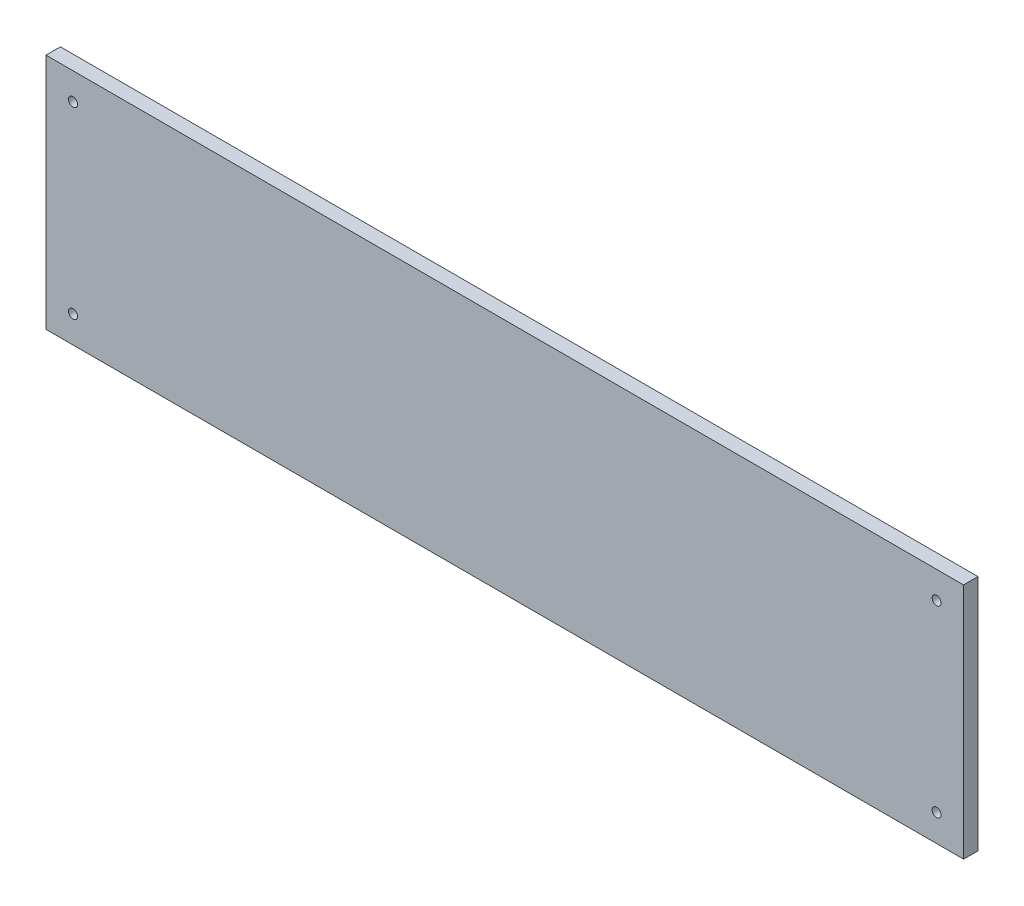
ISO-10303-21;
HEADER;
FILE_DESCRIPTION(('STEP AP214'),'2;1');
FILE_NAME('part.step','',(''),(''),'','','');
FILE_SCHEMA(('AUTOMOTIVE_DESIGN { 1 0 10303 214 1 1 1 1 }'));
ENDSEC;
DATA;
#1=APPLICATION_CONTEXT('core data for automotive mechanical design processes');
#2=APPLICATION_PROTOCOL_DEFINITION('international standard','automotive_design',2000,#1);
#3=PRODUCT_CONTEXT('',#1,'mechanical');
#4=PRODUCT('Part','Part','',(#3));
#5=PRODUCT_RELATED_PRODUCT_CATEGORY('part','',(#4));
#6=PRODUCT_DEFINITION_FORMATION('','',#4);
#7=PRODUCT_DEFINITION_CONTEXT('part definition',#1,'design');
#8=PRODUCT_DEFINITION('design','',#6,#7);
#9=PRODUCT_DEFINITION_SHAPE('','',#8);
#10=(LENGTH_UNIT() NAMED_UNIT(*) SI_UNIT(.MILLI.,.METRE.));
#11=(NAMED_UNIT(*) PLANE_ANGLE_UNIT() SI_UNIT($,.RADIAN.));
#12=(NAMED_UNIT(*) SI_UNIT($,.STERADIAN.) SOLID_ANGLE_UNIT());
#13=UNCERTAINTY_MEASURE_WITH_UNIT(LENGTH_MEASURE(1.E-05),#10,'distance_accuracy_value','');
#14=(GEOMETRIC_REPRESENTATION_CONTEXT(3) GLOBAL_UNCERTAINTY_ASSIGNED_CONTEXT((#13)) GLOBAL_UNIT_ASSIGNED_CONTEXT((#10,
#11,#12)) REPRESENTATION_CONTEXT('',''));
#15=CARTESIAN_POINT('',(0.,0.,0.));
#16=DIRECTION('',(0.,0.,1.));
#17=DIRECTION('',(1.,0.,0.));
#18=AXIS2_PLACEMENT_3D('',#15,#16,#17);
#19=CARTESIAN_POINT('',(161.925,-5.07999999999994,-243.205));
#20=DIRECTION('',(1.,0.,0.));
#21=DIRECTION('',(0.,0.,-1.));
#22=AXIS2_PLACEMENT_3D('',#19,#20,#21);
#23=PLANE('',#22);
#24=DIRECTION('',(0.,1.,0.));
#25=VECTOR('',#24,1.);
#26=CARTESIAN_POINT('',(161.925,-5.07999999999994,-238.125));
#27=LINE('',#26,#25);
#28=CARTESIAN_POINT('',(161.925,-5.07999999999994,-238.125));
#29=VERTEX_POINT('',#28);
#30=CARTESIAN_POINT('',(161.925,78.7400000000001,-238.125));
#31=VERTEX_POINT('',#30);
#32=EDGE_CURVE('E98',#29,#31,#27,.T.);
#33=ORIENTED_EDGE('',*,*,#32,.F.);
#34=DIRECTION('',(0.,0.,1.));
#35=VECTOR('',#34,1.);
#36=CARTESIAN_POINT('',(161.925,-5.07999999999994,-243.205));
#37=LINE('',#36,#35);
#38=CARTESIAN_POINT('',(161.925,-5.07999999999994,-243.205));
#39=VERTEX_POINT('',#38);
#40=EDGE_CURVE('E11',#39,#29,#37,.T.);
#41=ORIENTED_EDGE('',*,*,#40,.F.);
#42=DIRECTION('',(0.,1.,0.));
#43=VECTOR('',#42,1.);
#44=CARTESIAN_POINT('',(161.925,-5.07999999999994,-243.205));
#45=LINE('',#44,#43);
#46=CARTESIAN_POINT('',(161.925,78.7400000000001,-243.205));
#47=VERTEX_POINT('',#46);
#48=EDGE_CURVE('E91',#39,#47,#45,.T.);
#49=ORIENTED_EDGE('',*,*,#48,.T.);
#50=DIRECTION('',(0.,0.,1.));
#51=VECTOR('',#50,1.);
#52=CARTESIAN_POINT('',(161.925,78.7400000000001,-243.205));
#53=LINE('',#52,#51);
#54=EDGE_CURVE('E36',#47,#31,#53,.T.);
#55=ORIENTED_EDGE('',*,*,#54,.T.);
#56=EDGE_LOOP('',(#33,#41,#49,#55));
#57=FACE_BOUND('',#56,.T.);
#58=ADVANCED_FACE('F33',(#57),#23,.T.);
#59=CARTESIAN_POINT('',(-161.925,-5.07999999999994,-243.205));
#60=DIRECTION('',(0.,-1.,0.));
#61=DIRECTION('',(0.,0.,-1.));
#62=AXIS2_PLACEMENT_3D('',#59,#60,#61);
#63=PLANE('',#62);
#64=DIRECTION('',(1.,0.,0.));
#65=VECTOR('',#64,1.);
#66=CARTESIAN_POINT('',(-161.925,-5.07999999999994,-238.125));
#67=LINE('',#66,#65);
#68=CARTESIAN_POINT('',(-161.925,-5.07999999999994,-238.125));
#69=VERTEX_POINT('',#68);
#70=EDGE_CURVE('E93',#69,#29,#67,.T.);
#71=ORIENTED_EDGE('',*,*,#70,.F.);
#72=DIRECTION('',(0.,0.,1.));
#73=VECTOR('',#72,1.);
#74=CARTESIAN_POINT('',(-161.925,-5.07999999999994,-243.205));
#75=LINE('',#74,#73);
#76=CARTESIAN_POINT('',(-161.925,-5.07999999999994,-243.205));
#77=VERTEX_POINT('',#76);
#78=EDGE_CURVE('E42',#77,#69,#75,.T.);
#79=ORIENTED_EDGE('',*,*,#78,.F.);
#80=DIRECTION('',(1.,0.,0.));
#81=VECTOR('',#80,1.);
#82=CARTESIAN_POINT('',(-161.925,-5.07999999999994,-243.205));
#83=LINE('',#82,#81);
#84=EDGE_CURVE('E88',#77,#39,#83,.T.);
#85=ORIENTED_EDGE('',*,*,#84,.T.);
#86=ORIENTED_EDGE('',*,*,#40,.T.);
#87=EDGE_LOOP('',(#71,#79,#85,#86));
#88=FACE_BOUND('',#87,.T.);
#89=ADVANCED_FACE('F109',(#88),#63,.T.);
#90=CARTESIAN_POINT('',(-161.925,-5.07999999999994,-243.205));
#91=DIRECTION('',(-1.,0.,0.));
#92=DIRECTION('',(0.,0.,1.));
#93=AXIS2_PLACEMENT_3D('',#90,#91,#92);
#94=PLANE('',#93);
#95=DIRECTION('',(0.,-1.,0.));
#96=VECTOR('',#95,1.);
#97=CARTESIAN_POINT('',(-161.925,-5.07999999999994,-238.125));
#98=LINE('',#97,#96);
#99=CARTESIAN_POINT('',(-161.925,78.7400000000001,-238.125));
#100=VERTEX_POINT('',#99);
#101=EDGE_CURVE('E83',#100,#69,#98,.T.);
#102=ORIENTED_EDGE('',*,*,#101,.F.);
#103=DIRECTION('',(0.,0.,1.));
#104=VECTOR('',#103,1.);
#105=CARTESIAN_POINT('',(-161.925,78.7400000000001,-243.205));
#106=LINE('',#105,#104);
#107=CARTESIAN_POINT('',(-161.925,78.7400000000001,-243.205));
#108=VERTEX_POINT('',#107);
#109=EDGE_CURVE('E78',#108,#100,#106,.T.);
#110=ORIENTED_EDGE('',*,*,#109,.F.);
#111=DIRECTION('',(0.,-1.,0.));
#112=VECTOR('',#111,1.);
#113=CARTESIAN_POINT('',(-161.925,-5.07999999999994,-243.205));
#114=LINE('',#113,#112);
#115=EDGE_CURVE('E81',#108,#77,#114,.T.);
#116=ORIENTED_EDGE('',*,*,#115,.T.);
#117=ORIENTED_EDGE('',*,*,#78,.T.);
#118=EDGE_LOOP('',(#102,#110,#116,#117));
#119=FACE_BOUND('',#118,.T.);
#120=ADVANCED_FACE('F80',(#119),#94,.T.);
#121=CARTESIAN_POINT('',(-161.925,78.7400000000001,-243.205));
#122=DIRECTION('',(0.,1.,0.));
#123=DIRECTION('',(0.,0.,1.));
#124=AXIS2_PLACEMENT_3D('',#121,#122,#123);
#125=PLANE('',#124);
#126=DIRECTION('',(-1.,0.,0.));
#127=VECTOR('',#126,1.);
#128=CARTESIAN_POINT('',(-161.925,78.7400000000001,-238.125));
#129=LINE('',#128,#127);
#130=EDGE_CURVE('E101',#31,#100,#129,.T.);
#131=ORIENTED_EDGE('',*,*,#130,.F.);
#132=ORIENTED_EDGE('',*,*,#54,.F.);
#133=DIRECTION('',(-1.,0.,0.));
#134=VECTOR('',#133,1.);
#135=CARTESIAN_POINT('',(-161.925,78.7400000000001,-243.205));
#136=LINE('',#135,#134);
#137=EDGE_CURVE('E87',#47,#108,#136,.T.);
#138=ORIENTED_EDGE('',*,*,#137,.T.);
#139=ORIENTED_EDGE('',*,*,#109,.T.);
#140=EDGE_LOOP('',(#131,#132,#138,#139));
#141=FACE_BOUND('',#140,.T.);
#142=ADVANCED_FACE('F90',(#141),#125,.T.);
#143=CARTESIAN_POINT('',(0.,0.,-243.205));
#144=DIRECTION('',(0.,0.,-1.));
#145=DIRECTION('',(-1.,0.,0.));
#146=AXIS2_PLACEMENT_3D('',#143,#144,#145);
#147=PLANE('',#146);
#148=CARTESIAN_POINT('',(-152.4,4.44500000000006,-243.205));
#149=DIRECTION('',(0.,0.,1.));
#150=DIRECTION('',(1.,0.,0.));
#151=AXIS2_PLACEMENT_3D('',#148,#149,#150);
#152=CIRCLE('',#151,1.58750000000086);
#153=CARTESIAN_POINT('',(-150.812499999999,4.44500000000006,-243.205));
#154=VERTEX_POINT('',#153);
#155=EDGE_CURVE('E150',#154,#154,#152,.T.);
#156=ORIENTED_EDGE('',*,*,#155,.T.);
#157=EDGE_LOOP('',(#156));
#158=FACE_BOUND('',#157,.T.);
#159=CARTESIAN_POINT('',(152.400000000001,4.44500000000006,-243.205));
#160=DIRECTION('',(0.,0.,1.));
#161=DIRECTION('',(1.,0.,0.));
#162=AXIS2_PLACEMENT_3D('',#159,#160,#161);
#163=CIRCLE('',#162,1.58749999999999);
#164=CARTESIAN_POINT('',(153.987500000001,4.44500000000006,-243.205));
#165=VERTEX_POINT('',#164);
#166=EDGE_CURVE('E158',#165,#165,#163,.T.);
#167=ORIENTED_EDGE('',*,*,#166,.T.);
#168=EDGE_LOOP('',(#167));
#169=FACE_BOUND('',#168,.T.);
#170=CARTESIAN_POINT('',(152.4,69.215,-243.205));
#171=DIRECTION('',(0.,0.,1.));
#172=DIRECTION('',(1.,0.,0.));
#173=AXIS2_PLACEMENT_3D('',#170,#171,#172);
#174=CIRCLE('',#173,1.58749999999999);
#175=CARTESIAN_POINT('',(153.9875,69.215,-243.205));
#176=VERTEX_POINT('',#175);
#177=EDGE_CURVE('E164',#176,#176,#174,.T.);
#178=ORIENTED_EDGE('',*,*,#177,.T.);
#179=EDGE_LOOP('',(#178));
#180=FACE_BOUND('',#179,.T.);
#181=CARTESIAN_POINT('',(-152.4,69.215,-243.205));
#182=DIRECTION('',(0.,0.,1.));
#183=DIRECTION('',(1.,0.,0.));
#184=AXIS2_PLACEMENT_3D('',#181,#182,#183);
#185=CIRCLE('',#184,1.58749999999999);
#186=CARTESIAN_POINT('',(-150.8125,69.215,-243.205));
#187=VERTEX_POINT('',#186);
#188=EDGE_CURVE('E102',#187,#187,#185,.T.);
#189=ORIENTED_EDGE('',*,*,#188,.T.);
#190=EDGE_LOOP('',(#189));
#191=FACE_BOUND('',#190,.T.);
#192=ORIENTED_EDGE('',*,*,#48,.F.);
#193=ORIENTED_EDGE('',*,*,#84,.F.);
#194=ORIENTED_EDGE('',*,*,#115,.F.);
#195=ORIENTED_EDGE('',*,*,#137,.F.);
#196=EDGE_LOOP('',(#192,#193,#194,#195));
#197=FACE_BOUND('',#196,.T.);
#198=ADVANCED_FACE('F86',(#158,#169,#180,#191,#197),#147,.T.);
#199=CARTESIAN_POINT('',(0.,0.,-238.125));
#200=DIRECTION('',(0.,0.,-1.));
#201=DIRECTION('',(-1.,0.,0.));
#202=AXIS2_PLACEMENT_3D('',#199,#200,#201);
#203=PLANE('',#202);
#204=CARTESIAN_POINT('',(-152.4,4.44500000000006,-238.125));
#205=DIRECTION('',(0.,0.,1.));
#206=DIRECTION('',(1.,0.,0.));
#207=AXIS2_PLACEMENT_3D('',#204,#205,#206);
#208=CIRCLE('',#207,1.58750000000086);
#209=CARTESIAN_POINT('',(-150.812499999999,4.44500000000006,-238.125));
#210=VERTEX_POINT('',#209);
#211=EDGE_CURVE('E153',#210,#210,#208,.T.);
#212=ORIENTED_EDGE('',*,*,#211,.F.);
#213=EDGE_LOOP('',(#212));
#214=FACE_BOUND('',#213,.T.);
#215=CARTESIAN_POINT('',(152.400000000001,4.44500000000006,-238.125));
#216=DIRECTION('',(0.,0.,1.));
#217=DIRECTION('',(1.,0.,0.));
#218=AXIS2_PLACEMENT_3D('',#215,#216,#217);
#219=CIRCLE('',#218,1.58749999999999);
#220=CARTESIAN_POINT('',(153.987500000001,4.44500000000006,-238.125));
#221=VERTEX_POINT('',#220);
#222=EDGE_CURVE('E155',#221,#221,#219,.T.);
#223=ORIENTED_EDGE('',*,*,#222,.F.);
#224=EDGE_LOOP('',(#223));
#225=FACE_BOUND('',#224,.T.);
#226=CARTESIAN_POINT('',(152.4,69.215,-238.125));
#227=DIRECTION('',(0.,0.,1.));
#228=DIRECTION('',(1.,0.,0.));
#229=AXIS2_PLACEMENT_3D('',#226,#227,#228);
#230=CIRCLE('',#229,1.58749999999999);
#231=CARTESIAN_POINT('',(153.9875,69.215,-238.125));
#232=VERTEX_POINT('',#231);
#233=EDGE_CURVE('E161',#232,#232,#230,.T.);
#234=ORIENTED_EDGE('',*,*,#233,.F.);
#235=EDGE_LOOP('',(#234));
#236=FACE_BOUND('',#235,.T.);
#237=CARTESIAN_POINT('',(-152.4,69.215,-238.125));
#238=DIRECTION('',(0.,0.,1.));
#239=DIRECTION('',(1.,0.,0.));
#240=AXIS2_PLACEMENT_3D('',#237,#238,#239);
#241=CIRCLE('',#240,1.58749999999999);
#242=CARTESIAN_POINT('',(-150.8125,69.215,-238.125));
#243=VERTEX_POINT('',#242);
#244=EDGE_CURVE('E167',#243,#243,#241,.T.);
#245=ORIENTED_EDGE('',*,*,#244,.F.);
#246=EDGE_LOOP('',(#245));
#247=FACE_BOUND('',#246,.T.);
#248=ORIENTED_EDGE('',*,*,#32,.T.);
#249=ORIENTED_EDGE('',*,*,#130,.T.);
#250=ORIENTED_EDGE('',*,*,#101,.T.);
#251=ORIENTED_EDGE('',*,*,#70,.T.);
#252=EDGE_LOOP('',(#248,#249,#250,#251));
#253=FACE_BOUND('',#252,.T.);
#254=ADVANCED_FACE('F108',(#214,#225,#236,#247,#253),#203,.F.);
#255=CARTESIAN_POINT('',(-152.4,69.215,-243.205));
#256=DIRECTION('',(0.,0.,1.));
#257=DIRECTION('',(1.,0.,0.));
#258=AXIS2_PLACEMENT_3D('',#255,#256,#257);
#259=CYLINDRICAL_SURFACE('',#258,1.58749999999999);
#260=ORIENTED_EDGE('',*,*,#188,.F.);
#261=EDGE_LOOP('',(#260));
#262=FACE_BOUND('',#261,.T.);
#263=ORIENTED_EDGE('',*,*,#244,.T.);
#264=EDGE_LOOP('',(#263));
#265=FACE_BOUND('',#264,.T.);
#266=ADVANCED_FACE('F127',(#262,#265),#259,.F.);
#267=CARTESIAN_POINT('',(152.4,69.215,-243.205));
#268=DIRECTION('',(0.,0.,1.));
#269=DIRECTION('',(1.,0.,0.));
#270=AXIS2_PLACEMENT_3D('',#267,#268,#269);
#271=CYLINDRICAL_SURFACE('',#270,1.58749999999999);
#272=ORIENTED_EDGE('',*,*,#177,.F.);
#273=EDGE_LOOP('',(#272));
#274=FACE_BOUND('',#273,.T.);
#275=ORIENTED_EDGE('',*,*,#233,.T.);
#276=EDGE_LOOP('',(#275));
#277=FACE_BOUND('',#276,.T.);
#278=ADVANCED_FACE('F134',(#274,#277),#271,.F.);
#279=CARTESIAN_POINT('',(152.400000000001,4.44500000000006,-243.205));
#280=DIRECTION('',(0.,0.,1.));
#281=DIRECTION('',(1.,0.,0.));
#282=AXIS2_PLACEMENT_3D('',#279,#280,#281);
#283=CYLINDRICAL_SURFACE('',#282,1.58749999999999);
#284=ORIENTED_EDGE('',*,*,#166,.F.);
#285=EDGE_LOOP('',(#284));
#286=FACE_BOUND('',#285,.T.);
#287=ORIENTED_EDGE('',*,*,#222,.T.);
#288=EDGE_LOOP('',(#287));
#289=FACE_BOUND('',#288,.T.);
#290=ADVANCED_FACE('F138',(#286,#289),#283,.F.);
#291=CARTESIAN_POINT('',(-152.4,4.44500000000006,-243.205));
#292=DIRECTION('',(0.,0.,1.));
#293=DIRECTION('',(1.,0.,0.));
#294=AXIS2_PLACEMENT_3D('',#291,#292,#293);
#295=CYLINDRICAL_SURFACE('',#294,1.58750000000086);
#296=ORIENTED_EDGE('',*,*,#155,.F.);
#297=EDGE_LOOP('',(#296));
#298=FACE_BOUND('',#297,.T.);
#299=ORIENTED_EDGE('',*,*,#211,.T.);
#300=EDGE_LOOP('',(#299));
#301=FACE_BOUND('',#300,.T.);
#302=ADVANCED_FACE('F142',(#298,#301),#295,.F.);
#303=CLOSED_SHELL('',(#58,#89,#120,#142,#198,#254,#266,#278,#290,#302));
#304=MANIFOLD_SOLID_BREP('B2',#303);
#305=ADVANCED_BREP_SHAPE_REPRESENTATION('',(#18,#304),#14);
#306=SHAPE_DEFINITION_REPRESENTATION(#9,#305);
ENDSEC;
END-ISO-10303-21;
